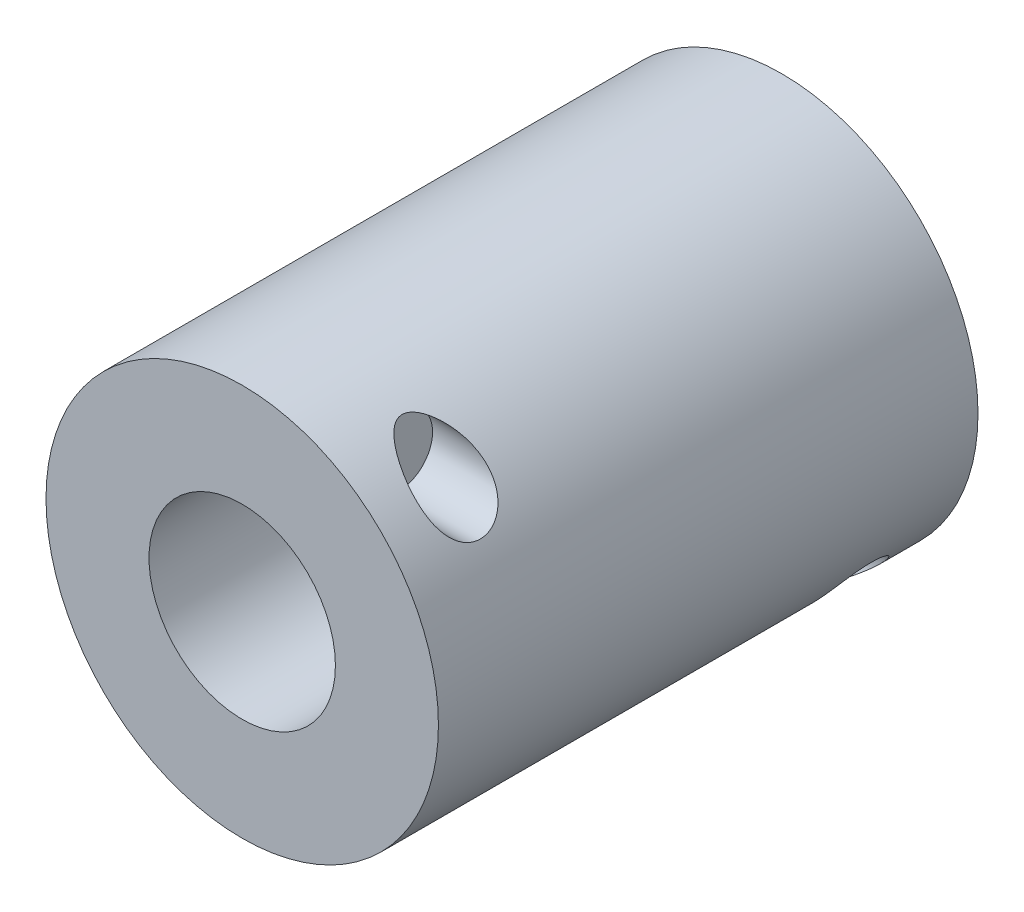
ISO-10303-21;
HEADER;
FILE_DESCRIPTION(('STEP AP214'),'2;1');
FILE_NAME('part.step','',(''),(''),'','','');
FILE_SCHEMA(('AUTOMOTIVE_DESIGN { 1 0 10303 214 1 1 1 1 }'));
ENDSEC;
DATA;
#1=APPLICATION_CONTEXT('core data for automotive mechanical design processes');
#2=APPLICATION_PROTOCOL_DEFINITION('international standard','automotive_design',2000,#1);
#3=PRODUCT_CONTEXT('',#1,'mechanical');
#4=PRODUCT('Part','Part','',(#3));
#5=PRODUCT_RELATED_PRODUCT_CATEGORY('part','',(#4));
#6=PRODUCT_DEFINITION_FORMATION('','',#4);
#7=PRODUCT_DEFINITION_CONTEXT('part definition',#1,'design');
#8=PRODUCT_DEFINITION('design','',#6,#7);
#9=PRODUCT_DEFINITION_SHAPE('','',#8);
#10=(LENGTH_UNIT() NAMED_UNIT(*) SI_UNIT(.MILLI.,.METRE.));
#11=(NAMED_UNIT(*) PLANE_ANGLE_UNIT() SI_UNIT($,.RADIAN.));
#12=(NAMED_UNIT(*) SI_UNIT($,.STERADIAN.) SOLID_ANGLE_UNIT());
#13=UNCERTAINTY_MEASURE_WITH_UNIT(LENGTH_MEASURE(1.E-05),#10,'distance_accuracy_value','');
#14=(GEOMETRIC_REPRESENTATION_CONTEXT(3) GLOBAL_UNCERTAINTY_ASSIGNED_CONTEXT((#13)) GLOBAL_UNIT_ASSIGNED_CONTEXT((#10,
#11,#12)) REPRESENTATION_CONTEXT('',''));
#15=CARTESIAN_POINT('',(0.,0.,0.));
#16=DIRECTION('',(0.,0.,1.));
#17=DIRECTION('',(1.,0.,0.));
#18=AXIS2_PLACEMENT_3D('',#15,#16,#17);
#19=CARTESIAN_POINT('',(0.,0.,55.));
#20=DIRECTION('',(0.,0.,-1.));
#21=DIRECTION('',(-1.,0.,0.));
#22=AXIS2_PLACEMENT_3D('',#19,#20,#21);
#23=CYLINDRICAL_SURFACE('',#22,20.);
#24=CARTESIAN_POINT('',(0.,0.,55.));
#25=DIRECTION('',(0.,0.,1.));
#26=DIRECTION('',(1.,0.,0.));
#27=AXIS2_PLACEMENT_3D('',#24,#25,#26);
#28=CIRCLE('',#27,20.);
#29=CARTESIAN_POINT('',(20.,0.,55.));
#30=VERTEX_POINT('',#29);
#31=EDGE_CURVE('E10',#30,#30,#28,.T.);
#32=ORIENTED_EDGE('',*,*,#31,.F.);
#33=EDGE_LOOP('',(#32));
#34=FACE_BOUND('',#33,.T.);
#35=CARTESIAN_POINT('',(0.,0.,0.));
#36=DIRECTION('',(0.,0.,1.));
#37=DIRECTION('',(1.,0.,0.));
#38=AXIS2_PLACEMENT_3D('',#35,#36,#37);
#39=CIRCLE('',#38,20.);
#40=CARTESIAN_POINT('',(20.,0.,0.));
#41=VERTEX_POINT('',#40);
#42=EDGE_CURVE('E50',#41,#41,#39,.T.);
#43=ORIENTED_EDGE('',*,*,#42,.T.);
#44=EDGE_LOOP('',(#43));
#45=FACE_BOUND('',#44,.T.);
#46=CARTESIAN_POINT('',(13.7816535958019,-14.493654617291,11.0712249012249));
#47=CARTESIAN_POINT('',(13.6260343943002,-14.6416292144459,11.0712260228679));
#48=CARTESIAN_POINT('',(13.4680354387345,-14.7870820907181,11.061854409074));
#49=CARTESIAN_POINT('',(13.1484504579042,-15.0719647553638,11.0261028299107));
#50=CARTESIAN_POINT('',(12.9868622031708,-15.2113906322075,10.9997119907649));
#51=CARTESIAN_POINT('',(12.6606185458845,-15.4839955365035,10.9311451030498));
#52=CARTESIAN_POINT('',(12.4959530869701,-15.6171457601287,10.8889029964772));
#53=CARTESIAN_POINT('',(12.1653468733274,-15.8760326166013,10.7896480784373));
#54=CARTESIAN_POINT('',(11.9994064545185,-16.0017711313191,10.7326390363732));
#55=CARTESIAN_POINT('',(11.6624187455635,-16.2490903196139,10.6024874024083));
#56=CARTESIAN_POINT('',(11.4913653907634,-16.3704384723954,10.5289179972277));
#57=CARTESIAN_POINT('',(11.150405495133,-16.6045552527508,10.3666503003642));
#58=CARTESIAN_POINT('',(10.9804996455096,-16.7173190680367,10.2779436118919));
#59=CARTESIAN_POINT('',(10.6440588405596,-16.9335125807081,10.0848087331123));
#60=CARTESIAN_POINT('',(10.4775188586145,-17.0369571405464,9.98040631070136));
#61=CARTESIAN_POINT('',(10.2324220137815,-17.1844890543224,9.81064452184327));
#62=CARTESIAN_POINT('',(10.1515404973108,-17.2323759609523,9.75189077691553));
#63=CARTESIAN_POINT('',(9.99187782799353,-17.3254407840667,9.6295973686792));
#64=CARTESIAN_POINT('',(9.91309612058157,-17.3706194198302,9.56605898630878));
#65=CARTESIAN_POINT('',(9.76193353079272,-17.4559971960885,9.43676680935152));
#66=CARTESIAN_POINT('',(9.68942512561565,-17.4963299950268,9.37125135692535));
#67=CARTESIAN_POINT('',(9.54789707454336,-17.5739627693569,9.23491197006816));
#68=CARTESIAN_POINT('',(9.47887572593768,-17.6112642304566,9.16409066923222));
#69=CARTESIAN_POINT('',(9.34583160597342,-17.6822251693063,9.01679488907038));
#70=CARTESIAN_POINT('',(9.28178795862469,-17.7159001145531,8.9403469675616));
#71=CARTESIAN_POINT('',(9.16019153116585,-17.7790768897489,8.78091268035757));
#72=CARTESIAN_POINT('',(9.10263139831722,-17.8085834567738,8.69793390633564));
#73=CARTESIAN_POINT('',(8.99841160500101,-17.8614634585857,8.52802952157723));
#74=CARTESIAN_POINT('',(8.95142486619475,-17.8850249484093,8.4413674567515));
#75=CARTESIAN_POINT('',(8.86873761415007,-17.9261717530495,8.26138996320387));
#76=CARTESIAN_POINT('',(8.83303136700998,-17.943760104369,8.16807794432824));
#77=CARTESIAN_POINT('',(8.77603525597844,-17.9717069457995,7.97468676889165));
#78=CARTESIAN_POINT('',(8.75492556921098,-17.9819751234016,7.87453924106701));
#79=CARTESIAN_POINT('',(8.73083971686136,-17.993683484617,7.67160989923658));
#80=CARTESIAN_POINT('',(8.72783812472325,-17.9951360467305,7.56883198258504));
#81=CARTESIAN_POINT('',(8.73957814834136,-17.9894353313109,7.37747092818666));
#82=CARTESIAN_POINT('',(8.75216099246661,-17.9833291553013,7.28871112612885));
#83=CARTESIAN_POINT('',(8.79002905084344,-17.9648497766857,7.11462225117874));
#84=CARTESIAN_POINT('',(8.81532710549467,-17.9524702388484,7.02929674065647));
#85=CARTESIAN_POINT('',(8.88948095064673,-17.9158997662605,6.82772294580516));
#86=CARTESIAN_POINT('',(8.94379153934178,-17.8889172289901,6.71401687213167));
#87=CARTESIAN_POINT('',(9.06707676925284,-17.8267463198003,6.49730666747201));
#88=CARTESIAN_POINT('',(9.13609172514499,-17.7915353619483,6.39433314167134));
#89=CARTESIAN_POINT('',(9.27578464412765,-17.7190670797311,6.20906516322593));
#90=CARTESIAN_POINT('',(9.34545727645982,-17.6824535339906,6.12574055954073));
#91=CARTESIAN_POINT('',(9.49033134428326,-17.6051231335309,5.96603222014419));
#92=CARTESIAN_POINT('',(9.56553721193585,-17.5644029794948,5.88965416060806));
#93=CARTESIAN_POINT('',(9.72001773666287,-17.4793892006931,5.74295029656949));
#94=CARTESIAN_POINT('',(9.79930012911952,-17.4350886836052,5.67263673118728));
#95=CARTESIAN_POINT('',(9.96074518734371,-17.3433616715877,5.53755106052579));
#96=CARTESIAN_POINT('',(10.0429088544595,-17.2959340847443,5.47278090923881));
#97=CARTESIAN_POINT('',(10.2802987259256,-17.1565539636043,5.29514930315056));
#98=CARTESIAN_POINT('',(10.4380711121072,-17.0611266680135,5.18838693084718));
#99=CARTESIAN_POINT('',(10.7575670378765,-16.8615047682719,4.98993205931923));
#100=CARTESIAN_POINT('',(10.9192935008923,-16.7573035289458,4.89825112281211));
#101=CARTESIAN_POINT('',(11.2448545601711,-16.5406024229323,4.72887856642052));
#102=CARTESIAN_POINT('',(11.4086916499956,-16.4280918188365,4.65120550971542));
#103=CARTESIAN_POINT('',(11.7367617670144,-16.1953351335118,4.50971873915605));
#104=CARTESIAN_POINT('',(11.9009946700504,-16.0750912342461,4.44590113800435));
#105=CARTESIAN_POINT('',(12.2366937210524,-15.8211796627121,4.32960391802167));
#106=CARTESIAN_POINT('',(12.4081248460063,-15.6871438790704,4.27782333515961));
#107=CARTESIAN_POINT('',(12.7490272860075,-15.4113721082678,4.19058675734653));
#108=CARTESIAN_POINT('',(12.9184981267545,-15.269634302953,4.15513463580329));
#109=CARTESIAN_POINT('',(13.2538583446759,-14.9794608438308,4.10197592487344));
#110=CARTESIAN_POINT('',(13.4197549606576,-14.8310410779267,4.08422934738177));
#111=CARTESIAN_POINT('',(13.7468957450411,-14.5283371401702,4.06811568729458));
#112=CARTESIAN_POINT('',(13.9081424282231,-14.3740562468882,4.06973792484754));
#113=CARTESIAN_POINT('',(14.2742845663701,-14.0117758090282,4.09842870587102));
#114=CARTESIAN_POINT('',(14.4770495974088,-13.8020735653444,4.13330101504284));
#115=CARTESIAN_POINT('',(14.7698901639304,-13.4859608080269,4.21765491640569));
#116=CARTESIAN_POINT('',(14.865606710696,-13.3803447314406,4.25110693626275));
#117=CARTESIAN_POINT('',(15.0526990888068,-13.1695136127528,4.32941988921395));
#118=CARTESIAN_POINT('',(15.1440758067164,-13.0642984928162,4.37427848010923));
#119=CARTESIAN_POINT('',(15.3744811020967,-12.7934692292675,4.50632727817295));
#120=CARTESIAN_POINT('',(15.5096842274155,-12.6289847457929,4.60285450274368));
#121=CARTESIAN_POINT('',(15.7637830284118,-12.310346556934,4.82873942750267));
#122=CARTESIAN_POINT('',(15.88269751129,-12.1561810440866,4.95805876463236));
#123=CARTESIAN_POINT('',(16.0819438061499,-11.8909110563354,5.22500387529083));
#124=CARTESIAN_POINT('',(16.1653954098224,-11.7769541467427,5.35741131595614));
#125=CARTESIAN_POINT('',(16.2786098163979,-11.6194267388664,5.5720437117486));
#126=CARTESIAN_POINT('',(16.3143669027894,-11.5691335459645,5.64629338572826));
#127=CARTESIAN_POINT('',(16.3816421425202,-11.4736742802941,5.79981998491083));
#128=CARTESIAN_POINT('',(16.4131621049589,-11.4285060206566,5.87909474317207));
#129=CARTESIAN_POINT('',(16.471914304942,-11.343664488411,6.04278818069708));
#130=CARTESIAN_POINT('',(16.4991169056467,-11.3040294047238,6.12723732600209));
#131=CARTESIAN_POINT('',(16.5487449526907,-11.231250194041,6.30019616295877));
#132=CARTESIAN_POINT('',(16.5711726633182,-11.1981029910485,6.38870390568375));
#133=CARTESIAN_POINT('',(16.6110679005126,-11.1388375148394,6.56911874951482));
#134=CARTESIAN_POINT('',(16.6285360125188,-11.112718412033,6.66102544795365));
#135=CARTESIAN_POINT('',(16.6583565486394,-11.0679665102963,6.84745205592585));
#136=CARTESIAN_POINT('',(16.6707095671074,-11.0493328415958,6.94197166048762));
#137=CARTESIAN_POINT('',(16.6891283129342,-11.0214899968568,7.12236612704898));
#138=CARTESIAN_POINT('',(16.695731750366,-11.0114761886165,7.20806306121596));
#139=CARTESIAN_POINT('',(16.7047411487104,-10.9978039022945,7.38021233648276));
#140=CARTESIAN_POINT('',(16.7071457470467,-10.9941474872688,7.46666491365487));
#141=CARTESIAN_POINT('',(16.7077328426169,-10.9932554739203,7.63956095449115));
#142=CARTESIAN_POINT('',(16.7059183372849,-10.9960153172092,7.72600438101945));
#143=CARTESIAN_POINT('',(16.6980915941544,-11.0078961645204,7.89827094671742));
#144=CARTESIAN_POINT('',(16.6920778188696,-11.0170194984177,7.98409384706088));
#145=CARTESIAN_POINT('',(16.6685459785865,-11.0526207430988,8.23159647953581));
#146=CARTESIAN_POINT('',(16.645542301745,-11.0873318479331,8.39167867235861));
#147=CARTESIAN_POINT('',(16.5850181158692,-11.1776598298025,8.7028076742673));
#148=CARTESIAN_POINT('',(16.5474970705514,-11.23327747914,8.85385414932852));
#149=CARTESIAN_POINT('',(16.4574233105968,-11.3648471179294,9.14837636198457));
#150=CARTESIAN_POINT('',(16.4044181231732,-11.4414059734584,9.29144155466846));
#151=CARTESIAN_POINT('',(16.2852524376215,-11.6103930596042,9.5617654036263));
#152=CARTESIAN_POINT('',(16.2190886427189,-11.702825266357,9.68902008570692));
#153=CARTESIAN_POINT('',(16.0676150098072,-11.9100719246254,9.93851029246978));
#154=CARTESIAN_POINT('',(15.9810327724629,-12.0262125111641,10.0588657535996));
#155=CARTESIAN_POINT('',(15.7956604969715,-12.2686792358004,10.2779288788762));
#156=CARTESIAN_POINT('',(15.6968606649574,-12.3950135168073,10.3766189974787));
#157=CARTESIAN_POINT('',(15.4411340295914,-12.7133694571934,10.5932738123597));
#158=CARTESIAN_POINT('',(15.2783654383099,-12.9088895161844,10.6992425669197));
#159=CARTESIAN_POINT('',(14.9362157943844,-13.3033038584618,10.869616210678));
#160=CARTESIAN_POINT('',(14.7568147430503,-13.5022019625998,10.9339703019336));
#161=CARTESIAN_POINT('',(14.4446407412486,-13.8342605130748,11.0113337082012));
#162=CARTESIAN_POINT('',(14.3150768546705,-13.9683065869574,11.0341464927923));
#163=CARTESIAN_POINT('',(14.0514940130177,-14.2334248728278,11.0640827485761));
#164=CARTESIAN_POINT('',(13.9174802584228,-14.3645002745731,11.0712239222388));
#165=CARTESIAN_POINT('',(13.7816535958019,-14.493654617291,11.0712249012249));
#166=B_SPLINE_CURVE_WITH_KNOTS('',3,(#46,#47,#48,#49,#50,#51,#52,#53,#54,#55,#56,#57,#58,#59,
#60,#61,#62,#63,#64,#65,#66,#67,#68,#69,#70,#71,#72,#73,#74,#75,#76,#77,#78,#79,#80,#81,#82,#83,
#84,#85,#86,#87,#88,#89,#90,#91,#92,#93,#94,#95,#96,#97,#98,#99,#100,#101,#102,#103,#104,#105,
#106,#107,#108,#109,#110,#111,#112,#113,#114,#115,#116,#117,#118,#119,#120,#121,#122,#123,#124,
#125,#126,#127,#128,#129,#130,#131,#132,#133,#134,#135,#136,#137,#138,#139,#140,#141,#142,#143,
#144,#145,#146,#147,#148,#149,#150,#151,#152,#153,#154,#155,#156,#157,#158,#159,#160,#161,#162,
#163,#164,#165),.UNSPECIFIED.,.T.,.F.,(4,2,2,2,2,2,2,2,2,2,2,2,2,2,2,2,2,2,2,2,2,2,2,2,2,2,2,2,
2,2,2,2,2,2,2,2,2,2,2,2,2,2,2,2,2,2,2,2,2,2,2,2,2,2,2,2,2,2,2,4),(0.,0.644013394054023,
1.28843866378345,1.93557986350945,2.58255603669149,3.24864261743114,3.91509989076213,
4.58047474488309,4.91289212342702,5.24522082178337,5.5621806822903,5.87898424678209,
6.19437809924022,6.50941059415147,6.8126650060709,7.1157650240893,7.42254269029186,
7.72888949291681,7.99716339054153,8.26570874934777,8.65012161400155,9.03560229912995,
9.37897117871006,9.7226181581069,10.0669431909616,10.4113890989693,11.049612145715,
11.6883222509385,12.327872650032,12.9672433838273,13.6375881677833,14.3080918879068,
14.9770778187833,15.6456948917667,16.5235343989958,16.9623325778346,17.4010407275303,
18.0995445404362,18.7972349229786,19.3754012126427,19.6647329971527,19.9539408523602,
20.2450553178863,20.5360314257687,20.8269731720458,21.1178811025517,21.3771478740432,
21.6364987652502,21.8956654586454,22.1549270910024,22.6486797375118,23.1424506253812,
23.6524093690707,24.1624960398032,24.7253343253655,25.28862675419,26.1108715352935,
26.9341181240763,27.4968582089091,28.0589623011639),.UNSPECIFIED.);
#167=CARTESIAN_POINT('',(13.7816535958019,-14.493654617291,11.0712249012249));
#168=VERTEX_POINT('',#167);
#169=EDGE_CURVE('E61',#168,#168,#166,.T.);
#170=ORIENTED_EDGE('',*,*,#169,.F.);
#171=EDGE_LOOP('',(#170));
#172=FACE_BOUND('',#171,.T.);
#173=CARTESIAN_POINT('',(13.7816535958019,14.493654617291,50.9287750987751));
#174=CARTESIAN_POINT('',(13.9957004195607,14.2901158657914,50.9287789700893));
#175=CARTESIAN_POINT('',(14.2054345209566,14.0816093735315,50.9110612143398));
#176=CARTESIAN_POINT('',(14.6121228092704,13.6591258253486,50.8345985314285));
#177=CARTESIAN_POINT('',(14.8090704481719,13.4451460435013,50.7758327616861));
#178=CARTESIAN_POINT('',(15.1512605064345,13.0573274403675,50.6259725182749));
#179=CARTESIAN_POINT('',(15.2994467769028,12.8831614209872,50.542550587905));
#180=CARTESIAN_POINT('',(15.5800423652462,12.5423602216403,50.3410820323316));
#181=CARTESIAN_POINT('',(15.7124743789504,12.3757144282654,50.2230860855405));
#182=CARTESIAN_POINT('',(15.9367038430469,12.0850838899531,49.9741272011487));
#183=CARTESIAN_POINT('',(16.031577692802,11.9586759676869,49.8488281123438));
#184=CARTESIAN_POINT('',(16.1618262177328,11.7813751177858,49.6427725623127));
#185=CARTESIAN_POINT('',(16.2032490780981,11.7243021266386,49.5710305913492));
#186=CARTESIAN_POINT('',(16.2817735978752,11.6150059555205,49.4217442667093));
#187=CARTESIAN_POINT('',(16.3188771524196,11.5627806506393,49.344202482467));
#188=CARTESIAN_POINT('',(16.3887397219859,11.4635477302466,49.1830490398386));
#189=CARTESIAN_POINT('',(16.4214632246144,11.4165832153612,49.0993953802494));
#190=CARTESIAN_POINT('',(16.481930509731,11.3291126580401,48.9271077444221));
#191=CARTESIAN_POINT('',(16.5096767918623,11.2886033748274,48.8384762976459));
#192=CARTESIAN_POINT('',(16.5599481321992,11.2147276537264,48.6568810619831));
#193=CARTESIAN_POINT('',(16.582474453295,11.1813594883031,48.5639183275363));
#194=CARTESIAN_POINT('',(16.622096756508,11.1223722796135,48.3744471545148));
#195=CARTESIAN_POINT('',(16.6391935429687,11.0967520885717,48.277939243496));
#196=CARTESIAN_POINT('',(16.6659866666544,11.0564639829599,48.0946453737484));
#197=CARTESIAN_POINT('',(16.6763444334941,11.0408222437869,48.0081685075956));
#198=CARTESIAN_POINT('',(16.6927127542313,11.0160592766071,47.8338468742161));
#199=CARTESIAN_POINT('',(16.6987219058358,11.0069401519512,47.7460016750646));
#200=CARTESIAN_POINT('',(16.7063353326228,10.9953813367091,47.5697473890721));
#201=CARTESIAN_POINT('',(16.7079430987038,10.9929363526243,47.4813388048929));
#202=CARTESIAN_POINT('',(16.706756195419,10.9947390833711,47.3046104329103));
#203=CARTESIAN_POINT('',(16.7039599410793,10.998989207722,47.2162906885273));
#204=CARTESIAN_POINT('',(16.6896304186653,11.0207350502429,46.9640973943171));
#205=CARTESIAN_POINT('',(16.6726223574612,11.0465225194595,46.8011419440097));
#206=CARTESIAN_POINT('',(16.6237190203623,11.1199758722668,46.4827057908873));
#207=CARTESIAN_POINT('',(16.591824439781,11.1676407340151,46.327224739335));
#208=CARTESIAN_POINT('',(16.5132786932062,11.2834649645996,46.0247215205294));
#209=CARTESIAN_POINT('',(16.4663739469252,11.3519754391354,45.8779002315144));
#210=CARTESIAN_POINT('',(16.3591814640971,11.5059096773045,45.5987980025715));
#211=CARTESIAN_POINT('',(16.2988904694837,11.5913375579012,45.4665206142092));
#212=CARTESIAN_POINT('',(16.1603413936316,11.7838279052291,45.207247447988));
#213=CARTESIAN_POINT('',(16.0809569945063,11.8921434371356,45.0817888419255));
#214=CARTESIAN_POINT('',(15.909816764718,12.1201532952549,44.8514085383437));
#215=CARTESIAN_POINT('',(15.818053385933,12.2398545507119,44.7464994674247));
#216=CARTESIAN_POINT('',(15.5823542119651,12.539547262921,44.516595007681));
#217=CARTESIAN_POINT('',(15.432909031204,12.7233982661869,44.4022489282229));
#218=CARTESIAN_POINT('',(15.1172476479197,13.0969024210036,44.2127010564397));
#219=CARTESIAN_POINT('',(14.9510006833467,13.2865657553161,44.1375726754459));
#220=CARTESIAN_POINT('',(14.6629378520296,13.6024950306202,44.0415347054111));
#221=CARTESIAN_POINT('',(14.5445223337031,13.7290672029996,44.0109173897448));
#222=CARTESIAN_POINT('',(14.3030109010553,13.9804947972622,43.964237729965));
#223=CARTESIAN_POINT('',(14.1799134625133,14.1053496417339,43.9481801688457));
#224=CARTESIAN_POINT('',(13.9298222142977,14.3523867453798,43.9294307286512));
#225=CARTESIAN_POINT('',(13.8028237640724,14.4745654999616,43.9267554414627));
#226=CARTESIAN_POINT('',(13.5458429948848,14.7153373177495,43.9337270959825));
#227=CARTESIAN_POINT('',(13.415860687126,14.8339303944151,43.9433739914318));
#228=CARTESIAN_POINT('',(13.1126746999819,15.1033337493637,43.978836764488));
#229=CARTESIAN_POINT('',(12.9386282733161,15.2526632474613,44.00875543342));
#230=CARTESIAN_POINT('',(12.5878832595963,15.5433950878458,44.0865150670683));
#231=CARTESIAN_POINT('',(12.4111836240712,15.6847941858647,44.1343633060357));
#232=CARTESIAN_POINT('',(12.0563495999509,15.9591597070629,44.2469040701027));
#233=CARTESIAN_POINT('',(11.87821403457,16.092118202538,44.3116121477447));
#234=CARTESIAN_POINT('',(11.5221448059659,16.3489546245707,44.4572996919289));
#235=CARTESIAN_POINT('',(11.3442110899846,16.472836239449,44.5382724988176));
#236=CARTESIAN_POINT('',(11.0449330947233,16.6742682377554,44.6891598473168));
#237=CARTESIAN_POINT('',(10.9230798315414,16.7543135037585,44.7547688955351));
#238=CARTESIAN_POINT('',(10.6810641166912,16.9096280996158,44.8942201099265));
#239=CARTESIAN_POINT('',(10.5609013362202,16.984898368499,44.9680606494078));
#240=CARTESIAN_POINT('',(10.3236100552591,17.1301596573906,45.1243880391425));
#241=CARTESIAN_POINT('',(10.2064740391051,17.2001647905474,45.206850247406));
#242=CARTESIAN_POINT('',(9.97643200381267,17.3346046990207,45.3815449150831));
#243=CARTESIAN_POINT('',(9.86352330930609,17.3990430323862,45.4737710486653));
#244=CARTESIAN_POINT('',(9.64842157647271,17.5192047915267,45.665716920675));
#245=CARTESIAN_POINT('',(9.54598255405365,17.575169717772,45.7650056031579));
#246=CARTESIAN_POINT('',(9.35029248773226,17.6800538602701,45.9759358951362));
#247=CARTESIAN_POINT('',(9.25704212606131,17.7289725534847,46.087578420564));
#248=CARTESIAN_POINT('',(9.1015754093212,17.8091968180814,46.3028263017529));
#249=CARTESIAN_POINT('',(9.03682316987199,17.8420841440929,46.4039745581567));
#250=CARTESIAN_POINT('',(8.92188931665424,17.8998330667666,46.616384455654));
#251=CARTESIAN_POINT('',(8.87167232102567,17.9247141690643,46.7276206578437));
#252=CARTESIAN_POINT('',(8.8025960801079,17.9587132495504,46.9280351958686));
#253=CARTESIAN_POINT('',(8.77893793132102,17.9702696751813,47.0151201962085));
#254=CARTESIAN_POINT('',(8.74502449280121,17.9867983494354,47.192458866954));
#255=CARTESIAN_POINT('',(8.73475279196565,17.9917786601391,47.2827085179343));
#256=CARTESIAN_POINT('',(8.72882752900637,17.9946543723772,47.4640892326143));
#257=CARTESIAN_POINT('',(8.73321791572086,17.9925284734032,47.5552221283509));
#258=CARTESIAN_POINT('',(8.75614841194235,17.9813796466595,47.7352669328672));
#259=CARTESIAN_POINT('',(8.77470210760783,17.9723500965472,47.8241766244149));
#260=CARTESIAN_POINT('',(8.83049304714729,17.9450154754895,48.0207256675347));
#261=CARTESIAN_POINT('',(8.87138855598458,17.924881388539,48.1270522357564));
#262=CARTESIAN_POINT('',(8.96754595202648,17.8769679422108,48.3311364546332));
#263=CARTESIAN_POINT('',(9.02284121425977,17.849170812927,48.4288734835686));
#264=CARTESIAN_POINT('',(9.1338204287662,17.7925989053501,48.6008655902719));
#265=CARTESIAN_POINT('',(9.18803698765949,17.7646865027779,48.6763801513158));
#266=CARTESIAN_POINT('',(9.30176022218648,17.7054051118326,48.8219147562164));
#267=CARTESIAN_POINT('',(9.36127071618537,17.6740336245496,48.8919307644587));
#268=CARTESIAN_POINT('',(9.4843199498371,17.6083091615266,49.027081928046));
#269=CARTESIAN_POINT('',(9.54786652437621,17.5739503359099,49.0922070192371));
#270=CARTESIAN_POINT('',(9.67793550259381,17.5026591985502,49.2179395717836));
#271=CARTESIAN_POINT('',(9.74445900722386,17.4657259318438,49.2785453393011));
#272=CARTESIAN_POINT('',(9.94233140643323,17.3543167512309,49.4498495678069));
#273=CARTESIAN_POINT('',(10.0767210780762,17.2767167833857,49.5550241957527));
#274=CARTESIAN_POINT('',(10.3504751398162,17.1141200023087,49.7524574579601));
#275=CARTESIAN_POINT('',(10.4898437472408,17.029116826278,49.84470480045));
#276=CARTESIAN_POINT('',(10.7717352890939,16.8522240114248,50.0176885201243));
#277=CARTESIAN_POINT('',(10.9142633330477,16.7603225414042,50.0984043983843));
#278=CARTESIAN_POINT('',(11.2008026042001,16.5702018856731,50.2488162626845));
#279=CARTESIAN_POINT('',(11.3448133309053,16.4719847767022,50.3185158453518));
#280=CARTESIAN_POINT('',(11.6457252564757,16.2608024980957,50.4527049448879));
#281=CARTESIAN_POINT('',(11.8026736309173,16.1472947481602,50.5162362657706));
#282=CARTESIAN_POINT('',(12.1161748064764,15.9134084480429,50.6305308589957));
#283=CARTESIAN_POINT('',(12.2727274889254,15.7930280450356,50.6812906680829));
#284=CARTESIAN_POINT('',(12.5839351019964,15.5461858134099,50.7693274677504));
#285=CARTESIAN_POINT('',(12.7385946498713,15.4197458445629,50.8066493155593));
#286=CARTESIAN_POINT('',(13.0455779605605,15.1609088710833,50.8671498644746));
#287=CARTESIAN_POINT('',(13.1979030927896,15.0285155533676,50.8903371930307));
#288=CARTESIAN_POINT('',(13.4215826647867,14.8280388684146,50.9133870099504));
#289=CARTESIAN_POINT('',(13.4941917907112,14.7619923950951,50.919111594911));
#290=CARTESIAN_POINT('',(13.6385783694955,14.6286997277251,50.9268062410832));
#291=CARTESIAN_POINT('',(13.7103552387242,14.5614527669142,50.9287738092519));
#292=CARTESIAN_POINT('',(13.7816535958019,14.493654617291,50.9287750987751));
#293=B_SPLINE_CURVE_WITH_KNOTS('',3,(#173,#174,#175,#176,#177,#178,#179,#180,#181,#182,#183,
#184,#185,#186,#187,#188,#189,#190,#191,#192,#193,#194,#195,#196,#197,#198,#199,#200,#201,#202,
#203,#204,#205,#206,#207,#208,#209,#210,#211,#212,#213,#214,#215,#216,#217,#218,#219,#220,#221,
#222,#223,#224,#225,#226,#227,#228,#229,#230,#231,#232,#233,#234,#235,#236,#237,#238,#239,#240,
#241,#242,#243,#244,#245,#246,#247,#248,#249,#250,#251,#252,#253,#254,#255,#256,#257,#258,#259,
#260,#261,#262,#263,#264,#265,#266,#267,#268,#269,#270,#271,#272,#273,#274,#275,#276,#277,#278,
#279,#280,#281,#282,#283,#284,#285,#286,#287,#288,#289,#290,#291,#292),.UNSPECIFIED.,.T.,.F.,(4,
2,2,2,2,2,2,2,2,2,2,2,2,2,2,2,2,2,2,2,2,2,2,2,2,2,2,2,2,2,2,2,2,2,2,2,2,2,2,2,2,2,2,2,2,2,2,2,2,
2,2,2,2,2,2,2,2,2,2,4),(0.,0.885872270416355,1.77219467951114,2.4998190223701,3.22638210763693,
3.8287550484257,4.13023240525723,4.43157698373545,4.73523330527207,5.03873669596561,
5.34216658178941,5.64555149583295,5.91067047911392,6.175874916962,6.44086895052655,
6.70595837524661,7.2009973481887,7.69601320135995,8.19987735893823,8.70386428623556,
9.25304312717979,9.80255835813846,10.5874913229938,11.3738883765569,11.9012772738763,
12.428839359906,12.9570553769943,13.4852694110935,14.1781372236638,14.8712864462758,
15.5650773497528,16.258584754937,16.7379561944606,17.2172330688791,17.6951757238887,
18.1728106036896,18.6318655775571,19.0909546092827,19.4634353450355,19.8350016082451,
20.106835825503,20.3783364734013,20.6506516598032,20.9232283933903,21.2683484814969,
21.6142757033724,21.9050530209424,22.196041795298,22.4876138092168,22.7792945604266,
23.3407977084698,23.9027883033279,24.4657658116639,25.0285591363547,25.6395768109511,
26.2507599972792,26.8598836542062,27.4686351400349,27.7635209354876,28.0586023403515),.UNSPECIFIED.);
#294=CARTESIAN_POINT('',(13.7816535958019,14.493654617291,50.9287750987751));
#295=VERTEX_POINT('',#294);
#296=EDGE_CURVE('E41',#295,#295,#293,.T.);
#297=ORIENTED_EDGE('',*,*,#296,.F.);
#298=EDGE_LOOP('',(#297));
#299=FACE_BOUND('',#298,.T.);
#300=ADVANCED_FACE('F37',(#34,#45,#172,#299),#23,.T.);
#301=CARTESIAN_POINT('',(0.,0.,55.));
#302=DIRECTION('',(0.,0.,1.));
#303=DIRECTION('',(1.,0.,0.));
#304=AXIS2_PLACEMENT_3D('',#301,#302,#303);
#305=PLANE('',#304);
#306=ORIENTED_EDGE('',*,*,#31,.T.);
#307=EDGE_LOOP('',(#306));
#308=FACE_BOUND('',#307,.T.);
#309=CARTESIAN_POINT('',(0.,0.,55.));
#310=DIRECTION('',(0.,0.,1.));
#311=DIRECTION('',(1.,0.,0.));
#312=AXIS2_PLACEMENT_3D('',#309,#310,#311);
#313=CIRCLE('',#312,9.5);
#314=CARTESIAN_POINT('',(9.5,0.,55.));
#315=VERTEX_POINT('',#314);
#316=EDGE_CURVE('E56',#315,#315,#313,.T.);
#317=ORIENTED_EDGE('',*,*,#316,.F.);
#318=EDGE_LOOP('',(#317));
#319=FACE_BOUND('',#318,.T.);
#320=ADVANCED_FACE('F86',(#308,#319),#305,.T.);
#321=CARTESIAN_POINT('',(0.,0.,0.));
#322=DIRECTION('',(0.,0.,1.));
#323=DIRECTION('',(1.,0.,0.));
#324=AXIS2_PLACEMENT_3D('',#321,#322,#323);
#325=PLANE('',#324);
#326=ORIENTED_EDGE('',*,*,#42,.F.);
#327=EDGE_LOOP('',(#326));
#328=FACE_BOUND('',#327,.T.);
#329=CARTESIAN_POINT('',(0.,0.,0.));
#330=DIRECTION('',(0.,0.,1.));
#331=DIRECTION('',(1.,0.,0.));
#332=AXIS2_PLACEMENT_3D('',#329,#330,#331);
#333=CIRCLE('',#332,9.5);
#334=CARTESIAN_POINT('',(9.5,0.,0.));
#335=VERTEX_POINT('',#334);
#336=EDGE_CURVE('E59',#335,#335,#333,.T.);
#337=ORIENTED_EDGE('',*,*,#336,.T.);
#338=EDGE_LOOP('',(#337));
#339=FACE_BOUND('',#338,.T.);
#340=ADVANCED_FACE('F84',(#328,#339),#325,.F.);
#341=CARTESIAN_POINT('',(0.,0.,55.));
#342=DIRECTION('',(0.,0.,-1.));
#343=DIRECTION('',(-1.,0.,0.));
#344=AXIS2_PLACEMENT_3D('',#341,#342,#343);
#345=CYLINDRICAL_SURFACE('',#344,9.5);
#346=ORIENTED_EDGE('',*,*,#316,.T.);
#347=EDGE_LOOP('',(#346));
#348=FACE_BOUND('',#347,.T.);
#349=ORIENTED_EDGE('',*,*,#336,.F.);
#350=EDGE_LOOP('',(#349));
#351=FACE_BOUND('',#350,.T.);
#352=ADVANCED_FACE('F74',(#348,#351),#345,.F.);
#353=CARTESIAN_POINT('',(20.,-14.493654617291,7.57122490122491));
#354=DIRECTION('',(-1.,0.,0.));
#355=DIRECTION('',(0.,0.,1.));
#356=AXIS2_PLACEMENT_3D('',#353,#354,#355);
#357=CYLINDRICAL_SURFACE('',#356,3.5);
#358=CARTESIAN_POINT('',(8.33333333,-14.493654617291,7.57122490122491));
#359=DIRECTION('',(1.,0.,0.));
#360=DIRECTION('',(0.,0.,-1.));
#361=AXIS2_PLACEMENT_3D('',#358,#359,#360);
#362=CIRCLE('',#361,3.5);
#363=CARTESIAN_POINT('',(8.33333333,-14.493654617291,4.07122490122491));
#364=VERTEX_POINT('',#363);
#365=EDGE_CURVE('E113',#364,#364,#362,.T.);
#366=ORIENTED_EDGE('',*,*,#365,.F.);
#367=EDGE_LOOP('',(#366));
#368=FACE_BOUND('',#367,.T.);
#369=ORIENTED_EDGE('',*,*,#169,.T.);
#370=EDGE_LOOP('',(#369));
#371=FACE_BOUND('',#370,.T.);
#372=ADVANCED_FACE('F69',(#368,#371),#357,.F.);
#373=CARTESIAN_POINT('',(8.33333333,-14.493654617291,7.57122490122491));
#374=DIRECTION('',(1.,0.,0.));
#375=DIRECTION('',(0.,0.,-1.));
#376=AXIS2_PLACEMENT_3D('',#373,#374,#375);
#377=PLANE('',#376);
#378=ORIENTED_EDGE('',*,*,#365,.T.);
#379=EDGE_LOOP('',(#378));
#380=FACE_BOUND('',#379,.T.);
#381=ADVANCED_FACE('F73',(#380),#377,.T.);
#382=CARTESIAN_POINT('',(20.,14.493654617291,47.4287750987751));
#383=DIRECTION('',(-1.,0.,0.));
#384=DIRECTION('',(0.,0.,1.));
#385=AXIS2_PLACEMENT_3D('',#382,#383,#384);
#386=CYLINDRICAL_SURFACE('',#385,3.5);
#387=CARTESIAN_POINT('',(8.33333333,14.493654617291,47.4287750987751));
#388=DIRECTION('',(1.,0.,0.));
#389=DIRECTION('',(0.,0.,-1.));
#390=AXIS2_PLACEMENT_3D('',#387,#388,#389);
#391=CIRCLE('',#390,3.5);
#392=CARTESIAN_POINT('',(8.33333333,14.493654617291,43.9287750987751));
#393=VERTEX_POINT('',#392);
#394=EDGE_CURVE('E68',#393,#393,#391,.T.);
#395=ORIENTED_EDGE('',*,*,#394,.F.);
#396=EDGE_LOOP('',(#395));
#397=FACE_BOUND('',#396,.T.);
#398=ORIENTED_EDGE('',*,*,#296,.T.);
#399=EDGE_LOOP('',(#398));
#400=FACE_BOUND('',#399,.T.);
#401=ADVANCED_FACE('F76',(#397,#400),#386,.F.);
#402=CARTESIAN_POINT('',(8.33333333,14.493654617291,47.4287750987751));
#403=DIRECTION('',(1.,0.,0.));
#404=DIRECTION('',(0.,0.,-1.));
#405=AXIS2_PLACEMENT_3D('',#402,#403,#404);
#406=PLANE('',#405);
#407=ORIENTED_EDGE('',*,*,#394,.T.);
#408=EDGE_LOOP('',(#407));
#409=FACE_BOUND('',#408,.T.);
#410=ADVANCED_FACE('F121',(#409),#406,.T.);
#411=CLOSED_SHELL('',(#300,#320,#340,#352,#372,#381,#401,#410));
#412=MANIFOLD_SOLID_BREP('B2',#411);
#413=ADVANCED_BREP_SHAPE_REPRESENTATION('',(#18,#412),#14);
#414=SHAPE_DEFINITION_REPRESENTATION(#9,#413);
ENDSEC;
END-ISO-10303-21;
